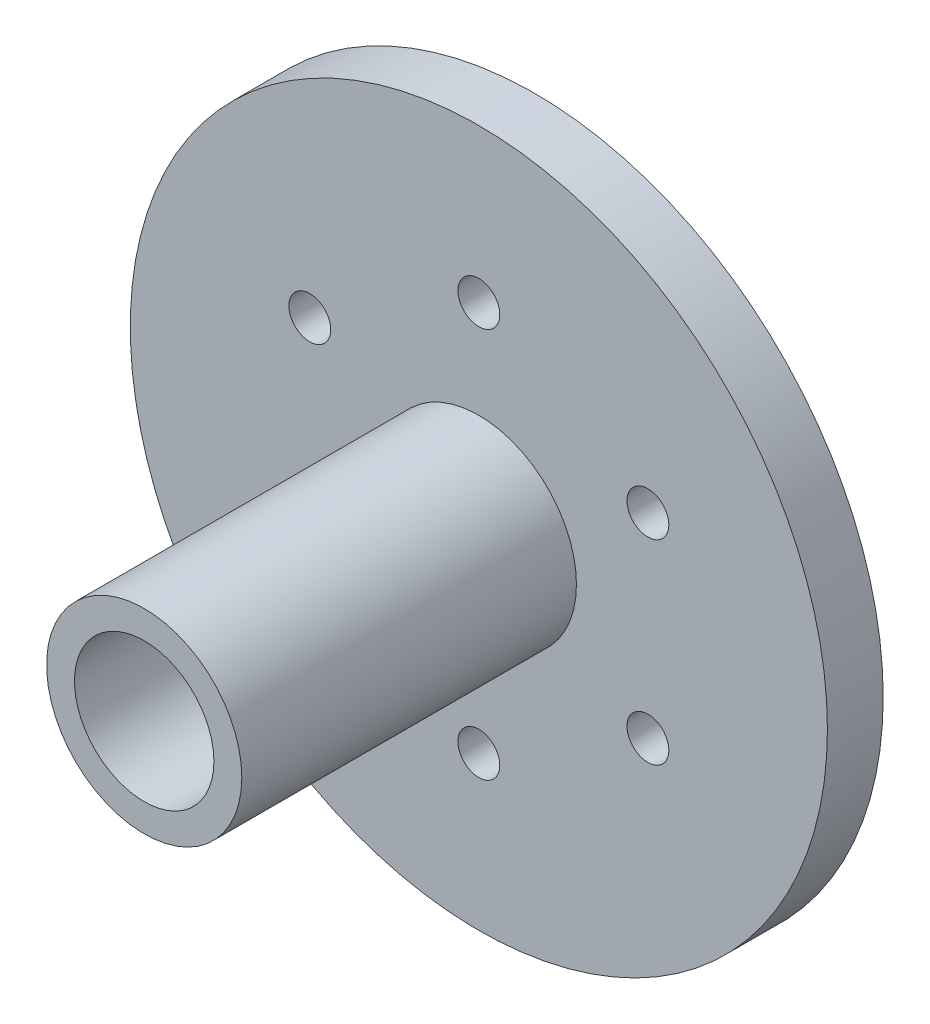
ISO-10303-21;
HEADER;
FILE_DESCRIPTION(('STEP AP214'),'2;1');
FILE_NAME('part.step','',(''),(''),'','','');
FILE_SCHEMA(('AUTOMOTIVE_DESIGN { 1 0 10303 214 1 1 1 1 }'));
ENDSEC;
DATA;
#1=APPLICATION_CONTEXT('core data for automotive mechanical design processes');
#2=APPLICATION_PROTOCOL_DEFINITION('international standard','automotive_design',2000,#1);
#3=PRODUCT_CONTEXT('',#1,'mechanical');
#4=PRODUCT('Part','Part','',(#3));
#5=PRODUCT_RELATED_PRODUCT_CATEGORY('part','',(#4));
#6=PRODUCT_DEFINITION_FORMATION('','',#4);
#7=PRODUCT_DEFINITION_CONTEXT('part definition',#1,'design');
#8=PRODUCT_DEFINITION('design','',#6,#7);
#9=PRODUCT_DEFINITION_SHAPE('','',#8);
#10=(LENGTH_UNIT() NAMED_UNIT(*) SI_UNIT(.MILLI.,.METRE.));
#11=(NAMED_UNIT(*) PLANE_ANGLE_UNIT() SI_UNIT($,.RADIAN.));
#12=(NAMED_UNIT(*) SI_UNIT($,.STERADIAN.) SOLID_ANGLE_UNIT());
#13=UNCERTAINTY_MEASURE_WITH_UNIT(LENGTH_MEASURE(1.E-05),#10,'distance_accuracy_value','');
#14=(GEOMETRIC_REPRESENTATION_CONTEXT(3) GLOBAL_UNCERTAINTY_ASSIGNED_CONTEXT((#13)) GLOBAL_UNIT_ASSIGNED_CONTEXT((#10,
#11,#12)) REPRESENTATION_CONTEXT('',''));
#15=CARTESIAN_POINT('',(0.,0.,0.));
#16=DIRECTION('',(0.,0.,1.));
#17=DIRECTION('',(1.,0.,0.));
#18=AXIS2_PLACEMENT_3D('',#15,#16,#17);
#19=CARTESIAN_POINT('',(0.,0.,4.));
#20=DIRECTION('',(0.,0.,-1.));
#21=DIRECTION('',(-1.,0.,0.));
#22=AXIS2_PLACEMENT_3D('',#19,#20,#21);
#23=CYLINDRICAL_SURFACE('',#22,25.);
#24=CARTESIAN_POINT('',(0.,0.,4.));
#25=DIRECTION('',(0.,0.,1.));
#26=DIRECTION('',(1.,0.,0.));
#27=AXIS2_PLACEMENT_3D('',#24,#25,#26);
#28=CIRCLE('',#27,25.);
#29=CARTESIAN_POINT('',(25.,0.,4.));
#30=VERTEX_POINT('',#29);
#31=EDGE_CURVE('E36',#30,#30,#28,.T.);
#32=ORIENTED_EDGE('',*,*,#31,.F.);
#33=EDGE_LOOP('',(#32));
#34=FACE_BOUND('',#33,.T.);
#35=CARTESIAN_POINT('',(0.,0.,0.));
#36=DIRECTION('',(0.,0.,1.));
#37=DIRECTION('',(1.,0.,0.));
#38=AXIS2_PLACEMENT_3D('',#35,#36,#37);
#39=CIRCLE('',#38,25.);
#40=CARTESIAN_POINT('',(25.,0.,0.));
#41=VERTEX_POINT('',#40);
#42=EDGE_CURVE('E40',#41,#41,#39,.T.);
#43=ORIENTED_EDGE('',*,*,#42,.T.);
#44=EDGE_LOOP('',(#43));
#45=FACE_BOUND('',#44,.T.);
#46=ADVANCED_FACE('F30',(#34,#45),#23,.T.);
#47=CARTESIAN_POINT('',(0.,0.,4.));
#48=DIRECTION('',(0.,0.,1.));
#49=DIRECTION('',(1.,0.,0.));
#50=AXIS2_PLACEMENT_3D('',#47,#48,#49);
#51=PLANE('',#50);
#52=CARTESIAN_POINT('',(0.,14.,4.));
#53=DIRECTION('',(0.,0.,1.));
#54=DIRECTION('',(1.,0.,0.));
#55=AXIS2_PLACEMENT_3D('',#52,#53,#54);
#56=CIRCLE('',#55,1.5);
#57=CARTESIAN_POINT('',(1.5,14.,4.));
#58=VERTEX_POINT('',#57);
#59=EDGE_CURVE('E55',#58,#58,#56,.T.);
#60=ORIENTED_EDGE('',*,*,#59,.F.);
#61=EDGE_LOOP('',(#60));
#62=FACE_BOUND('',#61,.T.);
#63=CARTESIAN_POINT('',(12.1243556529817,6.9999999999993,4.));
#64=DIRECTION('',(0.,0.,1.));
#65=DIRECTION('',(1.,0.,0.));
#66=AXIS2_PLACEMENT_3D('',#63,#64,#65);
#67=CIRCLE('',#66,1.50000000000075);
#68=CARTESIAN_POINT('',(13.6243556529825,6.9999999999993,4.));
#69=VERTEX_POINT('',#68);
#70=EDGE_CURVE('E58',#69,#69,#67,.T.);
#71=ORIENTED_EDGE('',*,*,#70,.F.);
#72=EDGE_LOOP('',(#71));
#73=FACE_BOUND('',#72,.T.);
#74=CARTESIAN_POINT('',(12.1243556529809,-7.00000000000069,4.));
#75=DIRECTION('',(0.,0.,1.));
#76=DIRECTION('',(1.,0.,0.));
#77=AXIS2_PLACEMENT_3D('',#74,#75,#76);
#78=CIRCLE('',#77,1.50000000000147);
#79=CARTESIAN_POINT('',(13.6243556529824,-7.00000000000069,4.));
#80=VERTEX_POINT('',#79);
#81=EDGE_CURVE('E61',#80,#80,#78,.T.);
#82=ORIENTED_EDGE('',*,*,#81,.F.);
#83=EDGE_LOOP('',(#82));
#84=FACE_BOUND('',#83,.T.);
#85=CARTESIAN_POINT('',(-1.58818671706501E-12,-14.,4.));
#86=DIRECTION('',(0.,0.,1.));
#87=DIRECTION('',(1.,0.,0.));
#88=AXIS2_PLACEMENT_3D('',#85,#86,#87);
#89=CIRCLE('',#88,1.50000000000161);
#90=CARTESIAN_POINT('',(1.50000000000002,-14.,4.));
#91=VERTEX_POINT('',#90);
#92=EDGE_CURVE('E64',#91,#91,#89,.T.);
#93=ORIENTED_EDGE('',*,*,#92,.F.);
#94=EDGE_LOOP('',(#93));
#95=FACE_BOUND('',#94,.T.);
#96=CARTESIAN_POINT('',(-12.1243556529833,-6.99999999999931,4.));
#97=DIRECTION('',(0.,0.,1.));
#98=DIRECTION('',(1.,0.,0.));
#99=AXIS2_PLACEMENT_3D('',#96,#97,#98);
#100=CIRCLE('',#99,1.500000000001);
#101=CARTESIAN_POINT('',(-10.6243556529823,-6.99999999999931,4.));
#102=VERTEX_POINT('',#101);
#103=EDGE_CURVE('E67',#102,#102,#100,.T.);
#104=ORIENTED_EDGE('',*,*,#103,.F.);
#105=EDGE_LOOP('',(#104));
#106=FACE_BOUND('',#105,.T.);
#107=CARTESIAN_POINT('',(-12.1243556529825,7.00000000000069,4.));
#108=DIRECTION('',(0.,0.,1.));
#109=DIRECTION('',(1.,0.,0.));
#110=AXIS2_PLACEMENT_3D('',#107,#108,#109);
#111=CIRCLE('',#110,1.50000000000021);
#112=CARTESIAN_POINT('',(-10.6243556529823,7.00000000000069,4.));
#113=VERTEX_POINT('',#112);
#114=EDGE_CURVE('E70',#113,#113,#111,.T.);
#115=ORIENTED_EDGE('',*,*,#114,.F.);
#116=EDGE_LOOP('',(#115));
#117=FACE_BOUND('',#116,.T.);
#118=CARTESIAN_POINT('',(0.,0.,4.));
#119=DIRECTION('',(0.,0.,1.));
#120=DIRECTION('',(1.,0.,0.));
#121=AXIS2_PLACEMENT_3D('',#118,#119,#120);
#122=CIRCLE('',#121,7.);
#123=CARTESIAN_POINT('',(7.,0.,4.));
#124=VERTEX_POINT('',#123);
#125=EDGE_CURVE('E47',#124,#124,#122,.T.);
#126=ORIENTED_EDGE('',*,*,#125,.F.);
#127=EDGE_LOOP('',(#126));
#128=FACE_BOUND('',#127,.T.);
#129=ORIENTED_EDGE('',*,*,#31,.T.);
#130=EDGE_LOOP('',(#129));
#131=FACE_BOUND('',#130,.T.);
#132=ADVANCED_FACE('F98',(#62,#73,#84,#95,#106,#117,#128,#131),#51,.T.);
#133=CARTESIAN_POINT('',(0.,0.,0.));
#134=DIRECTION('',(0.,0.,1.));
#135=DIRECTION('',(1.,0.,0.));
#136=AXIS2_PLACEMENT_3D('',#133,#134,#135);
#137=PLANE('',#136);
#138=CARTESIAN_POINT('',(0.,14.,0.));
#139=DIRECTION('',(0.,0.,-1.));
#140=DIRECTION('',(-1.,0.,0.));
#141=AXIS2_PLACEMENT_3D('',#138,#139,#140);
#142=CIRCLE('',#141,1.5);
#143=CARTESIAN_POINT('',(-1.5,14.,0.));
#144=VERTEX_POINT('',#143);
#145=EDGE_CURVE('E73',#144,#144,#142,.T.);
#146=ORIENTED_EDGE('',*,*,#145,.F.);
#147=EDGE_LOOP('',(#146));
#148=FACE_BOUND('',#147,.T.);
#149=CARTESIAN_POINT('',(12.1243556529817,6.9999999999993,0.));
#150=DIRECTION('',(0.,0.,-1.));
#151=DIRECTION('',(-1.,0.,0.));
#152=AXIS2_PLACEMENT_3D('',#149,#150,#151);
#153=CIRCLE('',#152,1.50000000000075);
#154=CARTESIAN_POINT('',(10.624355652981,6.9999999999993,0.));
#155=VERTEX_POINT('',#154);
#156=EDGE_CURVE('E78',#155,#155,#153,.T.);
#157=ORIENTED_EDGE('',*,*,#156,.F.);
#158=EDGE_LOOP('',(#157));
#159=FACE_BOUND('',#158,.T.);
#160=CARTESIAN_POINT('',(12.1243556529809,-7.00000000000069,0.));
#161=DIRECTION('',(0.,0.,-1.));
#162=DIRECTION('',(-1.,0.,0.));
#163=AXIS2_PLACEMENT_3D('',#160,#161,#162);
#164=CIRCLE('',#163,1.50000000000147);
#165=CARTESIAN_POINT('',(10.6243556529795,-7.00000000000069,0.));
#166=VERTEX_POINT('',#165);
#167=EDGE_CURVE('E74',#166,#166,#164,.T.);
#168=ORIENTED_EDGE('',*,*,#167,.F.);
#169=EDGE_LOOP('',(#168));
#170=FACE_BOUND('',#169,.T.);
#171=CARTESIAN_POINT('',(-1.58818671706501E-12,-14.,0.));
#172=DIRECTION('',(0.,0.,-1.));
#173=DIRECTION('',(-1.,0.,0.));
#174=AXIS2_PLACEMENT_3D('',#171,#172,#173);
#175=CIRCLE('',#174,1.50000000000161);
#176=CARTESIAN_POINT('',(-1.5000000000032,-14.,0.));
#177=VERTEX_POINT('',#176);
#178=EDGE_CURVE('E77',#177,#177,#175,.T.);
#179=ORIENTED_EDGE('',*,*,#178,.F.);
#180=EDGE_LOOP('',(#179));
#181=FACE_BOUND('',#180,.T.);
#182=CARTESIAN_POINT('',(-12.1243556529833,-6.99999999999931,0.));
#183=DIRECTION('',(0.,0.,-1.));
#184=DIRECTION('',(-1.,0.,0.));
#185=AXIS2_PLACEMENT_3D('',#182,#183,#184);
#186=CIRCLE('',#185,1.500000000001);
#187=CARTESIAN_POINT('',(-13.6243556529843,-6.99999999999931,0.));
#188=VERTEX_POINT('',#187);
#189=EDGE_CURVE('E81',#188,#188,#186,.T.);
#190=ORIENTED_EDGE('',*,*,#189,.F.);
#191=EDGE_LOOP('',(#190));
#192=FACE_BOUND('',#191,.T.);
#193=CARTESIAN_POINT('',(-12.1243556529825,7.00000000000069,0.));
#194=DIRECTION('',(0.,0.,-1.));
#195=DIRECTION('',(-1.,0.,0.));
#196=AXIS2_PLACEMENT_3D('',#193,#194,#195);
#197=CIRCLE('',#196,1.50000000000021);
#198=CARTESIAN_POINT('',(-13.6243556529827,7.00000000000069,0.));
#199=VERTEX_POINT('',#198);
#200=EDGE_CURVE('E84',#199,#199,#197,.T.);
#201=ORIENTED_EDGE('',*,*,#200,.F.);
#202=EDGE_LOOP('',(#201));
#203=FACE_BOUND('',#202,.T.);
#204=ORIENTED_EDGE('',*,*,#42,.F.);
#205=EDGE_LOOP('',(#204));
#206=FACE_BOUND('',#205,.T.);
#207=ADVANCED_FACE('F94',(#148,#159,#170,#181,#192,#203,#206),#137,.F.);
#208=CARTESIAN_POINT('',(0.,0.,28.));
#209=DIRECTION('',(0.,0.,1.));
#210=DIRECTION('',(1.,0.,0.));
#211=AXIS2_PLACEMENT_3D('',#208,#209,#210);
#212=PLANE('',#211);
#213=CARTESIAN_POINT('',(0.,0.,28.));
#214=DIRECTION('',(0.,0.,1.));
#215=DIRECTION('',(1.,0.,0.));
#216=AXIS2_PLACEMENT_3D('',#213,#214,#215);
#217=CIRCLE('',#216,7.);
#218=CARTESIAN_POINT('',(7.,0.,28.));
#219=VERTEX_POINT('',#218);
#220=EDGE_CURVE('E45',#219,#219,#217,.T.);
#221=ORIENTED_EDGE('',*,*,#220,.T.);
#222=EDGE_LOOP('',(#221));
#223=FACE_BOUND('',#222,.T.);
#224=CARTESIAN_POINT('',(0.,0.,28.));
#225=DIRECTION('',(0.,0.,1.));
#226=DIRECTION('',(1.,0.,0.));
#227=AXIS2_PLACEMENT_3D('',#224,#225,#226);
#228=CIRCLE('',#227,5.);
#229=CARTESIAN_POINT('',(5.,0.,28.));
#230=VERTEX_POINT('',#229);
#231=EDGE_CURVE('E50',#230,#230,#228,.T.);
#232=ORIENTED_EDGE('',*,*,#231,.F.);
#233=EDGE_LOOP('',(#232));
#234=FACE_BOUND('',#233,.T.);
#235=ADVANCED_FACE('F97',(#223,#234),#212,.T.);
#236=CARTESIAN_POINT('',(0.,0.,28.));
#237=DIRECTION('',(0.,0.,-1.));
#238=DIRECTION('',(-1.,0.,0.));
#239=AXIS2_PLACEMENT_3D('',#236,#237,#238);
#240=CYLINDRICAL_SURFACE('',#239,7.);
#241=ORIENTED_EDGE('',*,*,#220,.F.);
#242=EDGE_LOOP('',(#241));
#243=FACE_BOUND('',#242,.T.);
#244=ORIENTED_EDGE('',*,*,#125,.T.);
#245=EDGE_LOOP('',(#244));
#246=FACE_BOUND('',#245,.T.);
#247=ADVANCED_FACE('F135',(#243,#246),#240,.T.);
#248=CARTESIAN_POINT('',(0.,0.,28.));
#249=DIRECTION('',(0.,0.,-1.));
#250=DIRECTION('',(-1.,0.,0.));
#251=AXIS2_PLACEMENT_3D('',#248,#249,#250);
#252=CYLINDRICAL_SURFACE('',#251,5.);
#253=ORIENTED_EDGE('',*,*,#231,.T.);
#254=EDGE_LOOP('',(#253));
#255=FACE_BOUND('',#254,.T.);
#256=CARTESIAN_POINT('',(0.,0.,4.));
#257=DIRECTION('',(0.,0.,1.));
#258=DIRECTION('',(1.,0.,0.));
#259=AXIS2_PLACEMENT_3D('',#256,#257,#258);
#260=CIRCLE('',#259,5.);
#261=CARTESIAN_POINT('',(5.,0.,4.));
#262=VERTEX_POINT('',#261);
#263=EDGE_CURVE('E10',#262,#262,#260,.F.);
#264=ORIENTED_EDGE('',*,*,#263,.T.);
#265=EDGE_LOOP('',(#264));
#266=FACE_BOUND('',#265,.T.);
#267=ADVANCED_FACE('F126',(#255,#266),#252,.F.);
#268=ORIENTED_EDGE('',*,*,#263,.F.);
#269=EDGE_LOOP('',(#268));
#270=FACE_BOUND('',#269,.T.);
#271=ADVANCED_FACE('F118',(#270),#51,.T.);
#272=CARTESIAN_POINT('',(-12.1243556529825,7.00000000000069,24.));
#273=DIRECTION('',(0.,0.,-1.));
#274=DIRECTION('',(-1.,0.,0.));
#275=AXIS2_PLACEMENT_3D('',#272,#273,#274);
#276=CYLINDRICAL_SURFACE('',#275,1.50000000000021);
#277=ORIENTED_EDGE('',*,*,#114,.T.);
#278=EDGE_LOOP('',(#277));
#279=FACE_BOUND('',#278,.T.);
#280=ORIENTED_EDGE('',*,*,#200,.T.);
#281=EDGE_LOOP('',(#280));
#282=FACE_BOUND('',#281,.T.);
#283=ADVANCED_FACE('F125',(#279,#282),#276,.F.);
#284=CARTESIAN_POINT('',(-12.1243556529833,-6.99999999999931,24.));
#285=DIRECTION('',(0.,0.,-1.));
#286=DIRECTION('',(-1.,0.,0.));
#287=AXIS2_PLACEMENT_3D('',#284,#285,#286);
#288=CYLINDRICAL_SURFACE('',#287,1.500000000001);
#289=ORIENTED_EDGE('',*,*,#103,.T.);
#290=EDGE_LOOP('',(#289));
#291=FACE_BOUND('',#290,.T.);
#292=ORIENTED_EDGE('',*,*,#189,.T.);
#293=EDGE_LOOP('',(#292));
#294=FACE_BOUND('',#293,.T.);
#295=ADVANCED_FACE('F132',(#291,#294),#288,.F.);
#296=CARTESIAN_POINT('',(-1.58818671706501E-12,-14.,24.));
#297=DIRECTION('',(0.,0.,-1.));
#298=DIRECTION('',(-1.,0.,0.));
#299=AXIS2_PLACEMENT_3D('',#296,#297,#298);
#300=CYLINDRICAL_SURFACE('',#299,1.50000000000161);
#301=ORIENTED_EDGE('',*,*,#92,.T.);
#302=EDGE_LOOP('',(#301));
#303=FACE_BOUND('',#302,.T.);
#304=ORIENTED_EDGE('',*,*,#178,.T.);
#305=EDGE_LOOP('',(#304));
#306=FACE_BOUND('',#305,.T.);
#307=ADVANCED_FACE('F194',(#303,#306),#300,.F.);
#308=CARTESIAN_POINT('',(12.1243556529809,-7.00000000000069,24.));
#309=DIRECTION('',(0.,0.,-1.));
#310=DIRECTION('',(-1.,0.,0.));
#311=AXIS2_PLACEMENT_3D('',#308,#309,#310);
#312=CYLINDRICAL_SURFACE('',#311,1.50000000000147);
#313=ORIENTED_EDGE('',*,*,#81,.T.);
#314=EDGE_LOOP('',(#313));
#315=FACE_BOUND('',#314,.T.);
#316=ORIENTED_EDGE('',*,*,#167,.T.);
#317=EDGE_LOOP('',(#316));
#318=FACE_BOUND('',#317,.T.);
#319=ADVANCED_FACE('F144',(#315,#318),#312,.F.);
#320=CARTESIAN_POINT('',(12.1243556529817,6.9999999999993,24.));
#321=DIRECTION('',(0.,0.,-1.));
#322=DIRECTION('',(-1.,0.,0.));
#323=AXIS2_PLACEMENT_3D('',#320,#321,#322);
#324=CYLINDRICAL_SURFACE('',#323,1.50000000000075);
#325=ORIENTED_EDGE('',*,*,#70,.T.);
#326=EDGE_LOOP('',(#325));
#327=FACE_BOUND('',#326,.T.);
#328=ORIENTED_EDGE('',*,*,#156,.T.);
#329=EDGE_LOOP('',(#328));
#330=FACE_BOUND('',#329,.T.);
#331=ADVANCED_FACE('F212',(#327,#330),#324,.F.);
#332=CARTESIAN_POINT('',(0.,14.,24.));
#333=DIRECTION('',(0.,0.,-1.));
#334=DIRECTION('',(-1.,0.,0.));
#335=AXIS2_PLACEMENT_3D('',#332,#333,#334);
#336=CYLINDRICAL_SURFACE('',#335,1.5);
#337=ORIENTED_EDGE('',*,*,#59,.T.);
#338=EDGE_LOOP('',(#337));
#339=FACE_BOUND('',#338,.T.);
#340=ORIENTED_EDGE('',*,*,#145,.T.);
#341=EDGE_LOOP('',(#340));
#342=FACE_BOUND('',#341,.T.);
#343=ADVANCED_FACE('F92',(#339,#342),#336,.F.);
#344=CLOSED_SHELL('',(#46,#132,#207,#235,#247,#267,#271,#283,#295,#307,#319,#331,#343));
#345=MANIFOLD_SOLID_BREP('B2',#344);
#346=ADVANCED_BREP_SHAPE_REPRESENTATION('',(#18,#345),#14);
#347=SHAPE_DEFINITION_REPRESENTATION(#9,#346);
ENDSEC;
END-ISO-10303-21;
